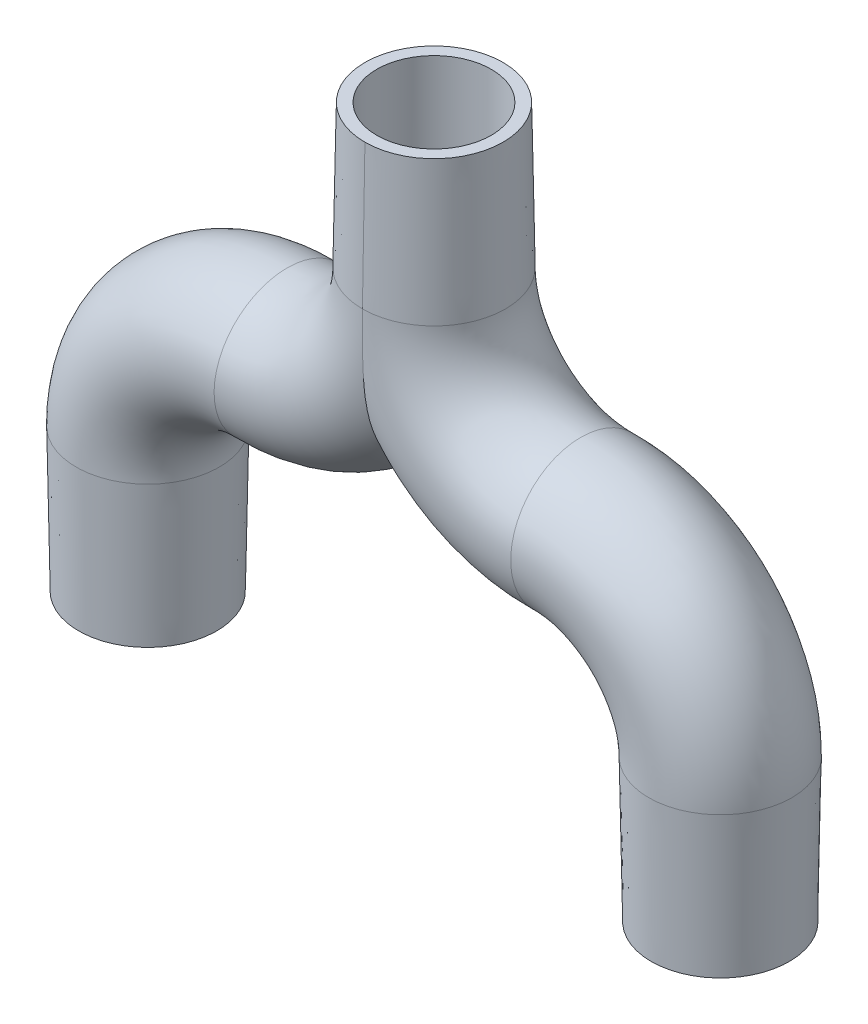
ISO-10303-21;
HEADER;
FILE_DESCRIPTION(('STEP AP214'),'2;1');
FILE_NAME('part.step','',(''),(''),'','','');
FILE_SCHEMA(('AUTOMOTIVE_DESIGN { 1 0 10303 214 1 1 1 1 }'));
ENDSEC;
DATA;
#1=APPLICATION_CONTEXT('core data for automotive mechanical design processes');
#2=APPLICATION_PROTOCOL_DEFINITION('international standard','automotive_design',2000,#1);
#3=PRODUCT_CONTEXT('',#1,'mechanical');
#4=PRODUCT('Part','Part','',(#3));
#5=PRODUCT_RELATED_PRODUCT_CATEGORY('part','',(#4));
#6=PRODUCT_DEFINITION_FORMATION('','',#4);
#7=PRODUCT_DEFINITION_CONTEXT('part definition',#1,'design');
#8=PRODUCT_DEFINITION('design','',#6,#7);
#9=PRODUCT_DEFINITION_SHAPE('','',#8);
#10=(LENGTH_UNIT() NAMED_UNIT(*) SI_UNIT(.MILLI.,.METRE.));
#11=(NAMED_UNIT(*) PLANE_ANGLE_UNIT() SI_UNIT($,.RADIAN.));
#12=(NAMED_UNIT(*) SI_UNIT($,.STERADIAN.) SOLID_ANGLE_UNIT());
#13=UNCERTAINTY_MEASURE_WITH_UNIT(LENGTH_MEASURE(1.E-05),#10,'distance_accuracy_value','');
#14=(GEOMETRIC_REPRESENTATION_CONTEXT(3) GLOBAL_UNCERTAINTY_ASSIGNED_CONTEXT((#13)) GLOBAL_UNIT_ASSIGNED_CONTEXT((#10,
#11,#12)) REPRESENTATION_CONTEXT('',''));
#15=CARTESIAN_POINT('',(0.,0.,0.));
#16=DIRECTION('',(0.,0.,1.));
#17=DIRECTION('',(1.,0.,0.));
#18=AXIS2_PLACEMENT_3D('',#15,#16,#17);
#19=CARTESIAN_POINT('',(0.,59.1431222892895,0.));
#20=DIRECTION('',(0.,-1.,0.));
#21=DIRECTION('',(0.,0.,1.));
#22=AXIS2_PLACEMENT_3D('',#19,#20,#21);
#23=CONICAL_SURFACE('',#22,10.,0.0174532925199434);
#24=CARTESIAN_POINT('',(0.,79.1431222892895,0.));
#25=DIRECTION('',(0.,1.,0.));
#26=DIRECTION('',(0.,0.,1.));
#27=AXIS2_PLACEMENT_3D('',#24,#25,#26);
#28=CIRCLE('',#27,9.65089870143565);
#29=CARTESIAN_POINT('',(0.,79.1431222892895,9.65089870143565));
#30=VERTEX_POINT('',#29);
#31=CARTESIAN_POINT('',(0.,79.1431222892895,-9.65089870143565));
#32=VERTEX_POINT('',#31);
#33=EDGE_CURVE('E346',#30,#32,#28,.T.);
#34=ORIENTED_EDGE('',*,*,#33,.F.);
#35=DIRECTION('',(0.,-0.999847695156391,0.0174524064372836));
#36=VECTOR('',#35,1.);
#37=CARTESIAN_POINT('',(0.,59.1431222892895,10.));
#38=LINE('',#37,#36);
#39=CARTESIAN_POINT('',(0.,59.1431222892895,10.));
#40=VERTEX_POINT('',#39);
#41=EDGE_CURVE('E12',#30,#40,#38,.T.);
#42=ORIENTED_EDGE('',*,*,#41,.T.);
#43=CARTESIAN_POINT('',(0.,59.1431222892895,0.));
#44=DIRECTION('',(0.,1.,0.));
#45=DIRECTION('',(0.,0.,1.));
#46=AXIS2_PLACEMENT_3D('',#43,#44,#45);
#47=CIRCLE('',#46,10.);
#48=CARTESIAN_POINT('',(0.,59.1431222892895,-10.));
#49=VERTEX_POINT('',#48);
#50=EDGE_CURVE('E149',#40,#49,#47,.T.);
#51=ORIENTED_EDGE('',*,*,#50,.T.);
#52=DIRECTION('',(0.,-0.999847695156391,-0.0174524064372836));
#53=VECTOR('',#52,1.);
#54=CARTESIAN_POINT('',(0.,59.1431222892895,-10.));
#55=LINE('',#54,#53);
#56=EDGE_CURVE('E67',#32,#49,#55,.T.);
#57=ORIENTED_EDGE('',*,*,#56,.F.);
#58=EDGE_LOOP('',(#34,#42,#51,#57));
#59=FACE_BOUND('',#58,.T.);
#60=ADVANCED_FACE('F57',(#59),#23,.T.);
#61=CARTESIAN_POINT('',(40.,0.,0.));
#62=DIRECTION('',(0.,1.,0.));
#63=DIRECTION('',(0.,0.,1.));
#64=AXIS2_PLACEMENT_3D('',#61,#62,#63);
#65=PLANE('',#64);
#66=CARTESIAN_POINT('',(40.,0.,0.));
#67=DIRECTION('',(0.,-1.,0.));
#68=DIRECTION('',(0.,0.,-1.));
#69=AXIS2_PLACEMENT_3D('',#66,#67,#68);
#70=CIRCLE('',#69,8.);
#71=CARTESIAN_POINT('',(40.,0.,-8.));
#72=VERTEX_POINT('',#71);
#73=EDGE_CURVE('E134',#72,#72,#70,.T.);
#74=ORIENTED_EDGE('',*,*,#73,.F.);
#75=EDGE_LOOP('',(#74));
#76=FACE_BOUND('',#75,.T.);
#77=CARTESIAN_POINT('',(40.,0.,0.));
#78=DIRECTION('',(0.,1.,0.));
#79=DIRECTION('',(0.,0.,1.));
#80=AXIS2_PLACEMENT_3D('',#77,#78,#79);
#81=CIRCLE('',#80,9.65089870143565);
#82=CARTESIAN_POINT('',(40.,0.,9.65089870143565));
#83=VERTEX_POINT('',#82);
#84=EDGE_CURVE('E85',#83,#83,#81,.T.);
#85=ORIENTED_EDGE('',*,*,#84,.F.);
#86=EDGE_LOOP('',(#85));
#87=FACE_BOUND('',#86,.T.);
#88=ADVANCED_FACE('F172',(#76,#87),#65,.F.);
#89=CARTESIAN_POINT('',(0.,79.1431222892895,0.));
#90=DIRECTION('',(0.,1.,0.));
#91=DIRECTION('',(0.,0.,1.));
#92=AXIS2_PLACEMENT_3D('',#89,#90,#91);
#93=PLANE('',#92);
#94=CARTESIAN_POINT('',(0.,79.1431222892895,0.));
#95=DIRECTION('',(0.,1.,0.));
#96=DIRECTION('',(0.,0.,1.));
#97=AXIS2_PLACEMENT_3D('',#94,#95,#96);
#98=CIRCLE('',#97,8.);
#99=CARTESIAN_POINT('',(0.,79.1431222892895,8.));
#100=VERTEX_POINT('',#99);
#101=EDGE_CURVE('E116',#100,#100,#98,.T.);
#102=ORIENTED_EDGE('',*,*,#101,.F.);
#103=EDGE_LOOP('',(#102));
#104=FACE_BOUND('',#103,.T.);
#105=CARTESIAN_POINT('',(0.,79.1431222892895,0.));
#106=DIRECTION('',(0.,1.,0.));
#107=DIRECTION('',(0.,0.,1.));
#108=AXIS2_PLACEMENT_3D('',#105,#106,#107);
#109=CIRCLE('',#108,9.65089870143565);
#110=EDGE_CURVE('E345',#32,#30,#109,.T.);
#111=ORIENTED_EDGE('',*,*,#110,.T.);
#112=ORIENTED_EDGE('',*,*,#33,.T.);
#113=EDGE_LOOP('',(#111,#112));
#114=FACE_BOUND('',#113,.T.);
#115=ADVANCED_FACE('F187',(#104,#114),#93,.T.);
#116=CARTESIAN_POINT('',(40.,20.,0.));
#117=DIRECTION('',(0.,1.,0.));
#118=DIRECTION('',(0.,0.,1.));
#119=AXIS2_PLACEMENT_3D('',#116,#117,#118);
#120=CONICAL_SURFACE('',#119,10.,0.0174532925199434);
#121=CARTESIAN_POINT('',(40.,20.,0.));
#122=DIRECTION('',(0.,1.,0.));
#123=DIRECTION('',(0.,0.,1.));
#124=AXIS2_PLACEMENT_3D('',#121,#122,#123);
#125=CIRCLE('',#124,10.);
#126=CARTESIAN_POINT('',(50.,20.,0.));
#127=VERTEX_POINT('',#126);
#128=EDGE_CURVE('E143',#127,#127,#125,.T.);
#129=ORIENTED_EDGE('',*,*,#128,.F.);
#130=EDGE_LOOP('',(#129));
#131=FACE_BOUND('',#130,.T.);
#132=ORIENTED_EDGE('',*,*,#84,.T.);
#133=EDGE_LOOP('',(#132));
#134=FACE_BOUND('',#133,.T.);
#135=ADVANCED_FACE('F180',(#131,#134),#120,.T.);
#136=CARTESIAN_POINT('',(21.1317876280369,20.,0.));
#137=DIRECTION('',(0.,0.,1.));
#138=DIRECTION('',(1.,0.,0.));
#139=AXIS2_PLACEMENT_3D('',#136,#137,#138);
#140=TOROIDAL_SURFACE('',#139,18.8682123719631,10.);
#141=CARTESIAN_POINT('',(20.7232655694847,38.8637893287955,0.));
#142=DIRECTION('',(-0.999765582288325,-0.0216513387966339,0.));
#143=DIRECTION('',(0.,0.,1.));
#144=AXIS2_PLACEMENT_3D('',#141,#142,#143);
#145=CIRCLE('',#144,10.);
#146=CARTESIAN_POINT('',(20.5067521815183,48.8614451516788,0.));
#147=VERTEX_POINT('',#146);
#148=EDGE_CURVE('E146',#147,#147,#145,.T.);
#149=CARTESIAN_POINT('',(21.1317876280369,20.,0.));
#150=DIRECTION('',(0.,0.,1.));
#151=DIRECTION('',(1.,0.,0.));
#152=AXIS2_PLACEMENT_3D('',#149,#150,#151);
#153=CIRCLE('',#152,28.8682123719631);
#154=EDGE_CURVE('',#127,#147,#153,.T.);
#155=ORIENTED_EDGE('',*,*,#128,.T.);
#156=ORIENTED_EDGE('',*,*,#148,.F.);
#157=ORIENTED_EDGE('',*,*,#154,.T.);
#158=ORIENTED_EDGE('',*,*,#154,.F.);
#159=EDGE_LOOP('',(#155,#157,#156,#158));
#160=FACE_BOUND('',#159,.T.);
#161=ADVANCED_FACE('F178',(#160),#140,.T.);
#162=CARTESIAN_POINT('',(20.2840879099653,59.1431222892895,0.));
#163=DIRECTION('',(0.,0.,-1.));
#164=DIRECTION('',(-1.,0.,0.));
#165=AXIS2_PLACEMENT_3D('',#162,#163,#164);
#166=TOROIDAL_SURFACE('',#165,20.2840879099653,10.);
#167=CARTESIAN_POINT('',(0.,59.1431222892895,-10.));
#168=CARTESIAN_POINT('',(0.,59.075983812123,-9.99999924301989));
#169=CARTESIAN_POINT('',(0.,59.0088453351664,-9.99999946741686));
#170=CARTESIAN_POINT('',(0.,58.5638779012477,-10.0000026658046));
#171=CARTESIAN_POINT('',(0.,58.186048948632,-10.0000135584307));
#172=CARTESIAN_POINT('',(0.,57.430390592289,-9.99979391511942));
#173=CARTESIAN_POINT('',(0.,57.0525611885617,-9.99956337890349));
#174=CARTESIAN_POINT('',(0.,56.2968568774636,-9.99819724614081));
#175=CARTESIAN_POINT('',(0.,55.9189819702118,-9.99706153827782));
#176=CARTESIAN_POINT('',(0.,55.1632404765593,-9.99286565151304));
#177=CARTESIAN_POINT('',(0.,54.7853738901686,-9.98980547042301));
#178=CARTESIAN_POINT('',(0.,54.0292215940289,-9.98041396039134));
#179=CARTESIAN_POINT('',(0.,53.6509359278018,-9.97407869486548));
#180=CARTESIAN_POINT('',(0.,52.8944691357887,-9.95651193168939));
#181=CARTESIAN_POINT('',(0.,52.5162880106689,-9.94528040352945));
#182=CARTESIAN_POINT('',(0.,51.7602596173793,-9.91606876856311));
#183=CARTESIAN_POINT('',(0.,51.3824122922814,-9.89809022073307));
#184=CARTESIAN_POINT('',(0.,50.6272376410586,-9.85333636583328));
#185=CARTESIAN_POINT('',(0.,50.2499103075513,-9.82656118497091));
#186=CARTESIAN_POINT('',(0.,49.332288415465,-9.74798134407743));
#187=CARTESIAN_POINT('',(0.,48.7924608815508,-9.6903558369953));
#188=CARTESIAN_POINT('',(0.,47.7165510950558,-9.54550507048272));
#189=CARTESIAN_POINT('',(0.,47.1804696724682,-9.45827345122531));
#190=CARTESIAN_POINT('',(0.,46.1169943301517,-9.2471617202654));
#191=CARTESIAN_POINT('',(0.,45.5895793934723,-9.12339084479277));
#192=CARTESIAN_POINT('',(0.,44.5471495966799,-8.83182100180424));
#193=CARTESIAN_POINT('',(0.,44.0321303371283,-8.66403791425669));
#194=CARTESIAN_POINT('',(0.,42.922273008748,-8.23914071468609));
#195=CARTESIAN_POINT('',(0.,42.3314754496497,-7.97098275492256));
#196=CARTESIAN_POINT('',(0.,41.4797488464761,-7.50609425394877));
#197=CARTESIAN_POINT('',(0.,41.2015427637305,-7.34065769349426));
#198=CARTESIAN_POINT('',(0.,40.6593096127529,-6.98787188760467));
#199=CARTESIAN_POINT('',(0.,40.3952798811324,-6.80052677941613));
#200=CARTESIAN_POINT('',(0.,39.9303985318301,-6.43893651323199));
#201=CARTESIAN_POINT('',(0.,39.7266979039141,-6.26834935324615));
#202=CARTESIAN_POINT('',(0.,39.3330589139682,-5.91198549827202));
#203=CARTESIAN_POINT('',(0.,39.1431177011746,-5.72621196676843));
#204=CARTESIAN_POINT('',(0.,38.7792428246492,-5.33982765980739));
#205=CARTESIAN_POINT('',(0.,38.6052970618988,-5.13922830931353));
#206=CARTESIAN_POINT('',(0.,38.2754995195259,-4.72365350294544));
#207=CARTESIAN_POINT('',(0.,38.1196450444165,-4.50868019624101));
#208=CARTESIAN_POINT('',(0.,37.8506365159316,-4.09935453062706));
#209=CARTESIAN_POINT('',(0.,37.7345993237203,-3.9068940854619));
#210=CARTESIAN_POINT('',(0.,37.5184602540885,-3.51323804921208));
#211=CARTESIAN_POINT('',(0.,37.418355593524,-3.31204399157409));
#212=CARTESIAN_POINT('',(0.,37.2353394628941,-2.90200471862412));
#213=CARTESIAN_POINT('',(0.,37.1524252604485,-2.69316072546916));
#214=CARTESIAN_POINT('',(0.,37.0048896444262,-2.26908888364854));
#215=CARTESIAN_POINT('',(0.,36.940268523598,-2.05386093287984));
#216=CARTESIAN_POINT('',(0.,36.8300366299147,-1.61769066405441));
#217=CARTESIAN_POINT('',(0.,36.7845004783878,-1.39672943753023));
#218=CARTESIAN_POINT('',(0.,36.713490783371,-0.951597015030077));
#219=CARTESIAN_POINT('',(0.,36.6880173601315,-0.727425799822504));
#220=CARTESIAN_POINT('',(0.,36.6575323446161,-0.277724138376335));
#221=CARTESIAN_POINT('',(0.,36.6525180226172,-0.0521938774878119));
#222=CARTESIAN_POINT('',(0.,36.6630241441215,0.398380017605707));
#223=CARTESIAN_POINT('',(0.,36.6785435626645,0.623423675538306));
#224=CARTESIAN_POINT('',(0.,36.7281241771027,1.05596855408723));
#225=CARTESIAN_POINT('',(0.,36.7608554666154,1.26362376039801));
#226=CARTESIAN_POINT('',(0.,36.8435197216063,1.67556626387057));
#227=CARTESIAN_POINT('',(0.,36.8934596762226,1.87985215723856));
#228=CARTESIAN_POINT('',(0.,37.0098837336256,2.28360972402299));
#229=CARTESIAN_POINT('',(0.,37.0763653692261,2.48308211050973));
#230=CARTESIAN_POINT('',(0.,37.2250295547603,2.87599601131134));
#231=CARTESIAN_POINT('',(0.,37.3072067646003,3.0694395508539));
#232=CARTESIAN_POINT('',(0.,37.4889514826294,3.45492717450976));
#233=CARTESIAN_POINT('',(0.,37.5889582849423,3.64676387445959));
#234=CARTESIAN_POINT('',(0.,37.8034639899514,4.02213173117092));
#235=CARTESIAN_POINT('',(0.,37.9179627429016,4.20566297372648));
#236=CARTESIAN_POINT('',(0.,38.160295166054,4.56378310134953));
#237=CARTESIAN_POINT('',(0.,38.2881337486749,4.73836865661071));
#238=CARTESIAN_POINT('',(0.,38.5558942068481,5.07802747759512));
#239=CARTESIAN_POINT('',(0.,38.6958183045405,5.24309898464625));
#240=CARTESIAN_POINT('',(0.,39.0440540323608,5.62673521267059));
#241=CARTESIAN_POINT('',(0.,39.2575260754175,5.84063616688665));
#242=CARTESIAN_POINT('',(0.,39.7024848277928,6.24880336092624));
#243=CARTESIAN_POINT('',(0.,39.9339771393798,6.44306345116319));
#244=CARTESIAN_POINT('',(0.,40.4122266742251,6.81216413588592));
#245=CARTESIAN_POINT('',(0.,40.6589968352449,6.98698791097728));
#246=CARTESIAN_POINT('',(0.,41.1651133645114,7.3175896587183));
#247=CARTESIAN_POINT('',(0.,41.4244671243102,7.47335624338177));
#248=CARTESIAN_POINT('',(0.,42.0733318534134,7.83303093672842));
#249=CARTESIAN_POINT('',(0.,42.4685179162139,8.02672535261503));
#250=CARTESIAN_POINT('',(0.,43.2745450635367,8.37844621935104));
#251=CARTESIAN_POINT('',(0.,43.6853953776099,8.53645124981308));
#252=CARTESIAN_POINT('',(0.,44.3101190955394,8.74948990849083));
#253=CARTESIAN_POINT('',(0.,44.5199886731571,8.81656461110377));
#254=CARTESIAN_POINT('',(0.,44.9419083863942,8.94312211286583));
#255=CARTESIAN_POINT('',(0.,45.1539575406804,9.00260817972736));
#256=CARTESIAN_POINT('',(0.,45.7927913594485,9.17044277365304));
#257=CARTESIAN_POINT('',(0.,46.2223752468414,9.26820549337401));
#258=CARTESIAN_POINT('',(0.,47.1569544052796,9.45345846846442));
#259=CARTESIAN_POINT('',(0.,47.6627840310905,9.53664819249601));
#260=CARTESIAN_POINT('',(0.,48.6781781084414,9.67634138355971));
#261=CARTESIAN_POINT('',(0.,49.1877437857123,9.73283565428939));
#262=CARTESIAN_POINT('',(0.,50.2095174962853,9.8250679085142));
#263=CARTESIAN_POINT('',(0.,50.7217284979271,9.86077158286311));
#264=CARTESIAN_POINT('',(0.,51.7468870056515,9.91678361861229));
#265=CARTESIAN_POINT('',(0.,52.2598344327598,9.93709352288794));
#266=CARTESIAN_POINT('',(0.,53.2869891934437,9.96730053361504));
#267=CARTESIAN_POINT('',(0.,53.8011970567909,9.97717759750503));
#268=CARTESIAN_POINT('',(0.,54.8296867936197,9.99069430822574));
#269=CARTESIAN_POINT('',(0.,55.3439686680502,9.99433386630744));
#270=CARTESIAN_POINT('',(0.,56.3721627818031,9.99868001377743));
#271=CARTESIAN_POINT('',(0.,56.8860750157687,9.99938875093512));
#272=CARTESIAN_POINT('',(0.,57.9138937696136,10.0000523120199));
#273=CARTESIAN_POINT('',(0.,58.427800289495,10.0000071440529));
#274=CARTESIAN_POINT('',(0.,59.0088453343885,9.99999901014761));
#275=CARTESIAN_POINT('',(0.,59.0759838112614,9.9999987184196));
#276=CARTESIAN_POINT('',(0.,59.1431222892895,10.));
#277=B_SPLINE_CURVE_WITH_KNOTS('',3,(#167,#168,#169,#170,#171,#172,#173,#174,#175,#176,#177,
#178,#179,#180,#181,#182,#183,#184,#185,#186,#187,#188,#189,#190,#191,#192,#193,#194,#195,#196,
#197,#198,#199,#200,#201,#202,#203,#204,#205,#206,#207,#208,#209,#210,#211,#212,#213,#214,#215,
#216,#217,#218,#219,#220,#221,#222,#223,#224,#225,#226,#227,#228,#229,#230,#231,#232,#233,#234,
#235,#236,#237,#238,#239,#240,#241,#242,#243,#244,#245,#246,#247,#248,#249,#250,#251,#252,#253,
#254,#255,#256,#257,#258,#259,#260,#261,#262,#263,#264,#265,#266,#267,#268,#269,#270,#271,#272,
#273,#274,#275,#276),.UNSPECIFIED.,.F.,.F.,(4,2,2,2,2,2,2,2,2,2,2,2,2,2,2,2,2,2,2,2,2,2,2,2,2,2,
2,2,2,2,2,2,2,2,2,2,2,2,2,2,2,2,2,2,2,2,2,2,2,2,2,2,2,2,4),(0.,0.201415430937982,
1.33490230502574,2.4683904864336,3.60201808349313,4.73564696955357,5.87064163338113,
7.00564336971619,8.14038301217685,9.27510637496811,10.9031459517408,12.5315354768695,
14.1551053018394,15.7780901332818,17.7178460184959,18.6880375761426,19.6580462161646,
20.4544203533643,21.2506290179399,22.0462303862024,22.8417130623467,23.5152299617134,
24.1886290796336,24.861921080262,25.5352238551272,26.2111351917833,26.8870505796363,
27.5628757816098,28.238667250433,28.8685931357362,29.498775161663,30.1288632524332,
30.7587373494401,31.4070821224604,32.0554201966528,32.703997870876,33.3526950527081,
34.25795034112,35.1634881943686,36.0698036619758,36.9766580974049,38.2948738928337,
39.6138787773238,40.2747425402471,40.9353207637217,42.2561208998186,43.7931083346072,
45.3306248600682,46.8706714943487,48.4105637535599,49.9534089537591,51.4962761058179,
53.0380124106553,54.5797321388645,54.7811475698025),.UNSPECIFIED.);
#278=EDGE_CURVE('E151',#49,#40,#277,.T.);
#279=ORIENTED_EDGE('',*,*,#278,.F.);
#280=ORIENTED_EDGE('',*,*,#50,.F.);
#281=EDGE_LOOP('',(#279,#280));
#282=FACE_BOUND('',#281,.T.);
#283=ORIENTED_EDGE('',*,*,#148,.T.);
#284=EDGE_LOOP('',(#283));
#285=FACE_BOUND('',#284,.T.);
#286=ADVANCED_FACE('F160',(#282,#285),#166,.T.);
#287=CARTESIAN_POINT('',(0.,59.1431222892895,0.));
#288=DIRECTION('',(0.,-1.,0.));
#289=DIRECTION('',(0.,0.,-1.));
#290=AXIS2_PLACEMENT_3D('',#287,#288,#289);
#291=CONICAL_SURFACE('',#290,10.,0.0174532925199434);
#292=ORIENTED_EDGE('',*,*,#41,.F.);
#293=ORIENTED_EDGE('',*,*,#110,.F.);
#294=ORIENTED_EDGE('',*,*,#56,.T.);
#295=CARTESIAN_POINT('',(0.,59.1431222892895,0.));
#296=DIRECTION('',(0.,1.,0.));
#297=DIRECTION('',(0.,0.,-1.));
#298=AXIS2_PLACEMENT_3D('',#295,#296,#297);
#299=CIRCLE('',#298,10.);
#300=EDGE_CURVE('E142',#49,#40,#299,.T.);
#301=ORIENTED_EDGE('',*,*,#300,.T.);
#302=EDGE_LOOP('',(#292,#293,#294,#301));
#303=FACE_BOUND('',#302,.T.);
#304=ADVANCED_FACE('F176',(#303),#291,.T.);
#305=CARTESIAN_POINT('',(-40.,0.,0.));
#306=DIRECTION('',(0.,1.,0.));
#307=DIRECTION('',(0.,0.,-1.));
#308=AXIS2_PLACEMENT_3D('',#305,#306,#307);
#309=PLANE('',#308);
#310=CARTESIAN_POINT('',(-40.,0.,0.));
#311=DIRECTION('',(0.,-1.,0.));
#312=DIRECTION('',(0.,0.,-1.));
#313=AXIS2_PLACEMENT_3D('',#310,#311,#312);
#314=CIRCLE('',#313,8.);
#315=CARTESIAN_POINT('',(-40.,0.,-8.));
#316=VERTEX_POINT('',#315);
#317=EDGE_CURVE('E376',#316,#316,#314,.T.);
#318=ORIENTED_EDGE('',*,*,#317,.F.);
#319=EDGE_LOOP('',(#318));
#320=FACE_BOUND('',#319,.T.);
#321=CARTESIAN_POINT('',(-40.,0.,0.));
#322=DIRECTION('',(0.,1.,0.));
#323=DIRECTION('',(0.,0.,1.));
#324=AXIS2_PLACEMENT_3D('',#321,#322,#323);
#325=CIRCLE('',#324,9.65089870143565);
#326=CARTESIAN_POINT('',(-40.,0.,-9.65089870143565));
#327=VERTEX_POINT('',#326);
#328=EDGE_CURVE('E61',#327,#327,#325,.T.);
#329=ORIENTED_EDGE('',*,*,#328,.F.);
#330=EDGE_LOOP('',(#329));
#331=FACE_BOUND('',#330,.T.);
#332=ADVANCED_FACE('F174',(#320,#331),#309,.F.);
#333=CARTESIAN_POINT('',(-40.,20.,0.));
#334=DIRECTION('',(0.,1.,0.));
#335=DIRECTION('',(0.,0.,-1.));
#336=AXIS2_PLACEMENT_3D('',#333,#334,#335);
#337=CONICAL_SURFACE('',#336,10.,0.0174532925199434);
#338=CARTESIAN_POINT('',(-40.,20.,0.));
#339=DIRECTION('',(0.,1.,0.));
#340=DIRECTION('',(0.,0.,-1.));
#341=AXIS2_PLACEMENT_3D('',#338,#339,#340);
#342=CIRCLE('',#341,10.);
#343=CARTESIAN_POINT('',(-50.,20.,0.));
#344=VERTEX_POINT('',#343);
#345=EDGE_CURVE('E136',#344,#344,#342,.T.);
#346=ORIENTED_EDGE('',*,*,#345,.F.);
#347=EDGE_LOOP('',(#346));
#348=FACE_BOUND('',#347,.T.);
#349=ORIENTED_EDGE('',*,*,#328,.T.);
#350=EDGE_LOOP('',(#349));
#351=FACE_BOUND('',#350,.T.);
#352=ADVANCED_FACE('F59',(#348,#351),#337,.T.);
#353=CARTESIAN_POINT('',(-21.1317876280369,20.,0.));
#354=DIRECTION('',(0.,0.,-1.));
#355=DIRECTION('',(-1.,0.,0.));
#356=AXIS2_PLACEMENT_3D('',#353,#354,#355);
#357=TOROIDAL_SURFACE('',#356,18.8682123719631,10.);
#358=CARTESIAN_POINT('',(-20.7232655694847,38.8637893287955,0.));
#359=DIRECTION('',(0.999765582288325,-0.0216513387966339,0.));
#360=DIRECTION('',(0.,0.,-1.));
#361=AXIS2_PLACEMENT_3D('',#358,#359,#360);
#362=CIRCLE('',#361,10.);
#363=CARTESIAN_POINT('',(-20.5067521815183,48.8614451516788,0.));
#364=VERTEX_POINT('',#363);
#365=EDGE_CURVE('E139',#364,#364,#362,.T.);
#366=CARTESIAN_POINT('',(-21.1317876280369,20.,0.));
#367=DIRECTION('',(0.,0.,-1.));
#368=DIRECTION('',(-1.,0.,0.));
#369=AXIS2_PLACEMENT_3D('',#366,#367,#368);
#370=CIRCLE('',#369,28.8682123719631);
#371=EDGE_CURVE('',#344,#364,#370,.T.);
#372=ORIENTED_EDGE('',*,*,#345,.T.);
#373=ORIENTED_EDGE('',*,*,#365,.F.);
#374=ORIENTED_EDGE('',*,*,#371,.T.);
#375=ORIENTED_EDGE('',*,*,#371,.F.);
#376=EDGE_LOOP('',(#372,#374,#373,#375));
#377=FACE_BOUND('',#376,.T.);
#378=ADVANCED_FACE('F170',(#377),#357,.T.);
#379=CARTESIAN_POINT('',(-20.2840879099653,59.1431222892895,0.));
#380=DIRECTION('',(0.,0.,1.));
#381=DIRECTION('',(1.,0.,0.));
#382=AXIS2_PLACEMENT_3D('',#379,#380,#381);
#383=TOROIDAL_SURFACE('',#382,20.2840879099653,10.);
#384=ORIENTED_EDGE('',*,*,#300,.F.);
#385=ORIENTED_EDGE('',*,*,#278,.T.);
#386=EDGE_LOOP('',(#384,#385));
#387=FACE_BOUND('',#386,.T.);
#388=ORIENTED_EDGE('',*,*,#365,.T.);
#389=EDGE_LOOP('',(#388));
#390=FACE_BOUND('',#389,.T.);
#391=ADVANCED_FACE('F164',(#387,#390),#383,.T.);
#392=CARTESIAN_POINT('',(40.,0.,0.));
#393=DIRECTION('',(0.,1.,0.));
#394=DIRECTION('',(0.,0.,1.));
#395=AXIS2_PLACEMENT_3D('',#392,#393,#394);
#396=CYLINDRICAL_SURFACE('',#395,8.);
#397=CARTESIAN_POINT('',(40.,20.,0.));
#398=DIRECTION('',(0.,-1.,0.));
#399=DIRECTION('',(1.,0.,0.));
#400=AXIS2_PLACEMENT_3D('',#397,#398,#399);
#401=CIRCLE('',#400,8.);
#402=CARTESIAN_POINT('',(48.,20.,0.));
#403=VERTEX_POINT('',#402);
#404=EDGE_CURVE('E107',#403,#403,#401,.F.);
#405=ORIENTED_EDGE('',*,*,#404,.T.);
#406=EDGE_LOOP('',(#405));
#407=FACE_BOUND('',#406,.T.);
#408=ORIENTED_EDGE('',*,*,#73,.T.);
#409=EDGE_LOOP('',(#408));
#410=FACE_BOUND('',#409,.T.);
#411=ADVANCED_FACE('F169',(#407,#410),#396,.F.);
#412=CARTESIAN_POINT('',(21.1317876280369,20.,0.));
#413=DIRECTION('',(0.,0.,1.));
#414=DIRECTION('',(1.,0.,0.));
#415=AXIS2_PLACEMENT_3D('',#412,#413,#414);
#416=TOROIDAL_SURFACE('',#415,18.8682123719631,8.);
#417=CARTESIAN_POINT('',(20.7232655694847,38.8637893287955,0.));
#418=DIRECTION('',(0.999765582288325,0.0216513387966351,0.));
#419=DIRECTION('',(-0.0216513387966351,0.999765582288325,0.));
#420=AXIS2_PLACEMENT_3D('',#417,#418,#419);
#421=CIRCLE('',#420,8.);
#422=CARTESIAN_POINT('',(20.5500548591116,46.8619139871021,0.));
#423=VERTEX_POINT('',#422);
#424=EDGE_CURVE('E117',#423,#423,#421,.F.);
#425=CARTESIAN_POINT('',(21.1317876280369,20.,0.));
#426=DIRECTION('',(0.,0.,1.));
#427=DIRECTION('',(1.,0.,0.));
#428=AXIS2_PLACEMENT_3D('',#425,#426,#427);
#429=CIRCLE('',#428,26.8682123719631);
#430=EDGE_CURVE('',#403,#423,#429,.T.);
#431=ORIENTED_EDGE('',*,*,#404,.F.);
#432=ORIENTED_EDGE('',*,*,#424,.T.);
#433=ORIENTED_EDGE('',*,*,#430,.T.);
#434=ORIENTED_EDGE('',*,*,#430,.F.);
#435=EDGE_LOOP('',(#431,#433,#432,#434));
#436=FACE_BOUND('',#435,.T.);
#437=ADVANCED_FACE('F234',(#436),#416,.F.);
#438=CARTESIAN_POINT('',(20.2840879099653,59.1431222892895,0.));
#439=DIRECTION('',(0.,0.,-1.));
#440=DIRECTION('',(-1.,0.,0.));
#441=AXIS2_PLACEMENT_3D('',#438,#439,#440);
#442=TOROIDAL_SURFACE('',#441,20.2840879099653,8.);
#443=CARTESIAN_POINT('',(0.,59.1431222892895,-8.));
#444=CARTESIAN_POINT('',(0.,59.0759838117079,-7.99999888847396));
#445=CARTESIAN_POINT('',(0.,59.0088453348007,-7.99999919241842));
#446=CARTESIAN_POINT('',(0.,58.5259986299056,-8.00000455092065));
#447=CARTESIAN_POINT('',(0.,58.110290419018,-8.00002607695934));
#448=CARTESIAN_POINT('',(0.,57.2788714157582,-7.99964037229336));
#449=CARTESIAN_POINT('',(0.,56.8631606233857,-7.99923313899594));
#450=CARTESIAN_POINT('',(0.,56.0315719751559,-7.99679032303519));
#451=CARTESIAN_POINT('',(0.,55.6156941204731,-7.99475407479296));
#452=CARTESIAN_POINT('',(0.,54.7839683161669,-7.98721049110341));
#453=CARTESIAN_POINT('',(0.,54.3681203662743,-7.98170319228037));
#454=CARTESIAN_POINT('',(0.,53.5372585268948,-7.96481595473354));
#455=CARTESIAN_POINT('',(0.,53.1222444498382,-7.95344629576665));
#456=CARTESIAN_POINT('',(0.,52.2924981081376,-7.92194373920983));
#457=CARTESIAN_POINT('',(0.,51.877765864348,-7.90181025167558));
#458=CARTESIAN_POINT('',(0.,51.0494072937271,-7.8494796619031));
#459=CARTESIAN_POINT('',(0.,50.6357803073572,-7.81729343815441));
#460=CARTESIAN_POINT('',(0.,49.8100836789448,-7.73716820193429));
#461=CARTESIAN_POINT('',(0.,49.3980137116652,-7.68923268692688));
#462=CARTESIAN_POINT('',(0.,48.6804175790181,-7.58817914800102));
#463=CARTESIAN_POINT('',(0.,48.3742805122762,-7.53943150032318));
#464=CARTESIAN_POINT('',(0.,47.7642710295326,-7.42906233920636));
#465=CARTESIAN_POINT('',(0.,47.4603988583664,-7.36743945427154));
#466=CARTESIAN_POINT('',(0.,46.8556077251968,-7.2293403323395));
#467=CARTESIAN_POINT('',(0.,46.554692992422,-7.15284537621244));
#468=CARTESIAN_POINT('',(0.,45.9576033060841,-6.98307639334881));
#469=CARTESIAN_POINT('',(0.,45.6614281483495,-6.88980309151974));
#470=CARTESIAN_POINT('',(0.,45.0722362577575,-6.68326611068054));
#471=CARTESIAN_POINT('',(0.,44.7792951222754,-6.56978468749834));
#472=CARTESIAN_POINT('',(0.,44.2024724049946,-6.3214776691517));
#473=CARTESIAN_POINT('',(0.,43.9185923192381,-6.1866485710185));
#474=CARTESIAN_POINT('',(0.,43.3636110803993,-5.89397145692391));
#475=CARTESIAN_POINT('',(0.,43.0924835919021,-5.7361739081492));
#476=CARTESIAN_POINT('',(0.,42.5664416889234,-5.39582343500299));
#477=CARTESIAN_POINT('',(0.,42.3115177062064,-5.21328532332435));
#478=CARTESIAN_POINT('',(0.,41.7555246067556,-4.76857414114961));
#479=CARTESIAN_POINT('',(0.,41.4607851070921,-4.49824968801275));
#480=CARTESIAN_POINT('',(0.,41.0529311035308,-4.06103339623056));
#481=CARTESIAN_POINT('',(0.,40.922641450157,-3.90993621276673));
#482=CARTESIAN_POINT('',(0.,40.6751139815231,-3.5974432751575));
#483=CARTESIAN_POINT('',(0.,40.557869859801,-3.43605255699156));
#484=CARTESIAN_POINT('',(0.,40.3369311945128,-3.10170382437651));
#485=CARTESIAN_POINT('',(0.,40.2333970080803,-2.92863953380905));
#486=CARTESIAN_POINT('',(0.,40.0432075573332,-2.57355312773666));
#487=CARTESIAN_POINT('',(0.,39.9565433202912,-2.39153583901203));
#488=CARTESIAN_POINT('',(0.,39.8017503245909,-2.01989040346592));
#489=CARTESIAN_POINT('',(0.,39.7336099784382,-1.83026710013205));
#490=CARTESIAN_POINT('',(0.,39.6172559886699,-1.44500414574433));
#491=CARTESIAN_POINT('',(0.,39.5690385065868,-1.24936566142542));
#492=CARTESIAN_POINT('',(0.,39.4989705689733,-0.882136959236169));
#493=CARTESIAN_POINT('',(0.,39.4743505777429,-0.711070971827695));
#494=CARTESIAN_POINT('',(0.,39.4410150983094,-0.367401554677534));
#495=CARTESIAN_POINT('',(0.,39.4322978676989,-0.194798295451762));
#496=CARTESIAN_POINT('',(0.,39.4309247546078,0.150410079090178));
#497=CARTESIAN_POINT('',(0.,39.4382634050036,0.323015173768296));
#498=CARTESIAN_POINT('',(0.,39.4688578082468,0.666803898348689));
#499=CARTESIAN_POINT('',(0.,39.4921130458978,0.837987574078674));
#500=CARTESIAN_POINT('',(0.,39.5514026075853,1.16262233910877));
#501=CARTESIAN_POINT('',(0.,39.5861385086239,1.31631280221297));
#502=CARTESIAN_POINT('',(0.,39.6680277089235,1.62039548529925));
#503=CARTESIAN_POINT('',(0.,39.7151848340528,1.77078667358234));
#504=CARTESIAN_POINT('',(0.,39.8212545626393,2.06728502598499));
#505=CARTESIAN_POINT('',(0.,39.8801624069201,2.21339389710395));
#506=CARTESIAN_POINT('',(0.,40.0090254664588,2.50070520206439));
#507=CARTESIAN_POINT('',(0.,40.0789847878291,2.64190578837618));
#508=CARTESIAN_POINT('',(0.,40.2336673033149,2.92711531498581));
#509=CARTESIAN_POINT('',(0.,40.3190267860145,3.07077926845663));
#510=CARTESIAN_POINT('',(0.,40.5002437777114,3.35134996739121));
#511=CARTESIAN_POINT('',(0.,40.596105366457,3.48825405667959));
#512=CARTESIAN_POINT('',(0.,40.8979722320478,3.88825241997767));
#513=CARTESIAN_POINT('',(0.,41.1183015547236,4.14070870119851));
#514=CARTESIAN_POINT('',(0.,41.532753567196,4.55869692746902));
#515=CARTESIAN_POINT('',(0.,41.7206008376706,4.73060306998265));
#516=CARTESIAN_POINT('',(0.,42.1107755394828,5.05721707621148));
#517=CARTESIAN_POINT('',(0.,42.3131090363961,5.21191766568598));
#518=CARTESIAN_POINT('',(0.,42.938258556476,5.65120066459039));
#519=CARTESIAN_POINT('',(0.,43.3789068625896,5.91065570604878));
#520=CARTESIAN_POINT('',(0.,44.1907678243055,6.31922635200841));
#521=CARTESIAN_POINT('',(0.,44.5563257244756,6.48006863237969));
#522=CARTESIAN_POINT('',(0.,45.3003507402939,6.76914146170293));
#523=CARTESIAN_POINT('',(0.,45.6788263137614,6.89735016063126));
#524=CARTESIAN_POINT('',(0.,46.4449007897737,7.12549565467881));
#525=CARTESIAN_POINT('',(0.,46.8325170842014,7.22537288802143));
#526=CARTESIAN_POINT('',(0.,47.6130027818624,7.40074467974011));
#527=CARTESIAN_POINT('',(0.,48.0058704255292,7.47624720212816));
#528=CARTESIAN_POINT('',(0.,48.8340672754761,7.61343638144122));
#529=CARTESIAN_POINT('',(0.,49.2697401068782,7.67300748957306));
#530=CARTESIAN_POINT('',(0.,50.143355877025,7.7726206919146));
#531=CARTESIAN_POINT('',(0.,50.5812994160625,7.812657324727));
#532=CARTESIAN_POINT('',(0.,51.4587753432738,7.87778215731734));
#533=CARTESIAN_POINT('',(0.,51.8983090055143,7.90285241469872));
#534=CARTESIAN_POINT('',(0.,52.7777926380242,7.94208377423776));
#535=CARTESIAN_POINT('',(0.,53.2177425693319,7.9562458123645));
#536=CARTESIAN_POINT('',(0.,54.0981142016148,7.97726520271713));
#537=CARTESIAN_POINT('',(0.,54.5385360147611,7.98411731415528));
#538=CARTESIAN_POINT('',(0.,55.4194226511038,7.99349881159826));
#539=CARTESIAN_POINT('',(0.,55.8598874747774,7.99602814241602));
#540=CARTESIAN_POINT('',(0.,56.7405798486112,7.99905813363609));
#541=CARTESIAN_POINT('',(0.,57.180807396495,7.9995599052281));
#542=CARTESIAN_POINT('',(0.,58.0612589072468,8.00003357207552));
#543=CARTESIAN_POINT('',(0.,58.5014828701156,8.0000054715294));
#544=CARTESIAN_POINT('',(0.,59.0088453346536,7.99999909350979));
#545=CARTESIAN_POINT('',(0.,59.0759838115456,7.99999877439663));
#546=CARTESIAN_POINT('',(0.,59.1431222892895,8.));
#547=B_SPLINE_CURVE_WITH_KNOTS('',3,(#443,#444,#445,#446,#447,#448,#449,#450,#451,#452,#453,
#454,#455,#456,#457,#458,#459,#460,#461,#462,#463,#464,#465,#466,#467,#468,#469,#470,#471,#472,
#473,#474,#475,#476,#477,#478,#479,#480,#481,#482,#483,#484,#485,#486,#487,#488,#489,#490,#491,
#492,#493,#494,#495,#496,#497,#498,#499,#500,#501,#502,#503,#504,#505,#506,#507,#508,#509,#510,
#511,#512,#513,#514,#515,#516,#517,#518,#519,#520,#521,#522,#523,#524,#525,#526,#527,#528,#529,
#530,#531,#532,#533,#534,#535,#536,#537,#538,#539,#540,#541,#542,#543,#544,#545,#546),
.UNSPECIFIED.,.F.,.F.,(4,2,2,2,2,2,2,2,2,2,2,2,2,2,2,2,2,2,2,2,2,2,2,2,2,2,2,2,2,2,2,2,2,2,2,2,
2,2,2,2,2,2,2,2,2,2,2,2,2,2,2,4),(0.,0.201415430937986,1.44854012612302,2.69567236283503,
3.94331441015634,5.1909432933855,6.43639183910934,7.68192423619367,8.92633514682534,
10.1704698962072,11.1002234640243,12.030076121577,12.961106830025,13.892097322999,
14.8338041315519,15.7756656264982,16.715488021027,17.6547501895957,18.8497026435236,
19.4476814959623,20.0453700062971,20.6495264220507,21.2533606179767,21.8568162157691,
22.4601554936367,22.9779311924503,23.4956501570647,24.0131928627146,24.530718817066,
25.0028935331104,25.4752138543706,25.9473432674572,26.419648511875,26.9204640513063,
27.4214748368363,28.4232386427383,29.1861722953377,29.9494272880209,31.4772473906929,
32.6738744478464,33.8713006191351,35.0712258143345,36.2707585571633,37.5893691543014,
38.9083481941868,40.2289053293252,41.5493491427227,42.8707390018144,44.1921457303919,
45.5128281729151,46.8335001509455,47.0349155818835),.UNSPECIFIED.);
#548=CARTESIAN_POINT('',(0.,59.1431222892895,-8.));
#549=VERTEX_POINT('',#548);
#550=CARTESIAN_POINT('',(0.,59.1431222892895,8.));
#551=VERTEX_POINT('',#550);
#552=EDGE_CURVE('E100',#549,#551,#547,.T.);
#553=ORIENTED_EDGE('',*,*,#552,.T.);
#554=CARTESIAN_POINT('',(0.,59.1431222892895,0.));
#555=DIRECTION('',(0.,1.,0.));
#556=DIRECTION('',(-1.,0.,0.));
#557=AXIS2_PLACEMENT_3D('',#554,#555,#556);
#558=CIRCLE('',#557,8.);
#559=EDGE_CURVE('E105',#551,#549,#558,.T.);
#560=ORIENTED_EDGE('',*,*,#559,.T.);
#561=EDGE_LOOP('',(#553,#560));
#562=FACE_BOUND('',#561,.T.);
#563=ORIENTED_EDGE('',*,*,#424,.F.);
#564=EDGE_LOOP('',(#563));
#565=FACE_BOUND('',#564,.T.);
#566=ADVANCED_FACE('F102',(#562,#565),#442,.F.);
#567=CARTESIAN_POINT('',(0.,59.1431222892895,0.));
#568=DIRECTION('',(0.,1.,0.));
#569=DIRECTION('',(-1.,0.,0.));
#570=AXIS2_PLACEMENT_3D('',#567,#568,#569);
#571=CYLINDRICAL_SURFACE('',#570,8.);
#572=ORIENTED_EDGE('',*,*,#101,.T.);
#573=EDGE_LOOP('',(#572));
#574=FACE_BOUND('',#573,.T.);
#575=ORIENTED_EDGE('',*,*,#559,.F.);
#576=CARTESIAN_POINT('',(0.,59.1431222892895,0.));
#577=DIRECTION('',(0.,1.,0.));
#578=DIRECTION('',(-1.,0.,0.));
#579=AXIS2_PLACEMENT_3D('',#576,#577,#578);
#580=CIRCLE('',#579,8.);
#581=EDGE_CURVE('E108',#549,#551,#580,.T.);
#582=ORIENTED_EDGE('',*,*,#581,.F.);
#583=EDGE_LOOP('',(#575,#582));
#584=FACE_BOUND('',#583,.T.);
#585=ADVANCED_FACE('F115',(#574,#584),#571,.F.);
#586=CARTESIAN_POINT('',(-40.,0.,0.));
#587=DIRECTION('',(0.,1.,0.));
#588=DIRECTION('',(0.,0.,1.));
#589=AXIS2_PLACEMENT_3D('',#586,#587,#588);
#590=CYLINDRICAL_SURFACE('',#589,8.);
#591=CARTESIAN_POINT('',(-40.,20.,0.));
#592=DIRECTION('',(0.,-1.,0.));
#593=DIRECTION('',(1.,0.,0.));
#594=AXIS2_PLACEMENT_3D('',#591,#592,#593);
#595=CIRCLE('',#594,8.);
#596=CARTESIAN_POINT('',(-48.,20.,0.));
#597=VERTEX_POINT('',#596);
#598=EDGE_CURVE('E132',#597,#597,#595,.F.);
#599=ORIENTED_EDGE('',*,*,#598,.T.);
#600=EDGE_LOOP('',(#599));
#601=FACE_BOUND('',#600,.T.);
#602=ORIENTED_EDGE('',*,*,#317,.T.);
#603=EDGE_LOOP('',(#602));
#604=FACE_BOUND('',#603,.T.);
#605=ADVANCED_FACE('F255',(#601,#604),#590,.F.);
#606=CARTESIAN_POINT('',(-21.1317876280369,20.,0.));
#607=DIRECTION('',(0.,0.,-1.));
#608=DIRECTION('',(-1.,0.,0.));
#609=AXIS2_PLACEMENT_3D('',#606,#607,#608);
#610=TOROIDAL_SURFACE('',#609,18.8682123719631,8.);
#611=CARTESIAN_POINT('',(-20.7232655694847,38.8637893287955,0.));
#612=DIRECTION('',(-0.999765582288325,0.0216513387966351,0.));
#613=DIRECTION('',(-0.0216513387966351,-0.999765582288325,0.));
#614=AXIS2_PLACEMENT_3D('',#611,#612,#613);
#615=CIRCLE('',#614,8.);
#616=CARTESIAN_POINT('',(-20.5500548591116,46.8619139871021,0.));
#617=VERTEX_POINT('',#616);
#618=EDGE_CURVE('E113',#617,#617,#615,.F.);
#619=CARTESIAN_POINT('',(-21.1317876280369,20.,0.));
#620=DIRECTION('',(0.,0.,-1.));
#621=DIRECTION('',(-1.,0.,0.));
#622=AXIS2_PLACEMENT_3D('',#619,#620,#621);
#623=CIRCLE('',#622,26.8682123719631);
#624=EDGE_CURVE('',#597,#617,#623,.T.);
#625=ORIENTED_EDGE('',*,*,#598,.F.);
#626=ORIENTED_EDGE('',*,*,#618,.T.);
#627=ORIENTED_EDGE('',*,*,#624,.T.);
#628=ORIENTED_EDGE('',*,*,#624,.F.);
#629=EDGE_LOOP('',(#625,#627,#626,#628));
#630=FACE_BOUND('',#629,.T.);
#631=ADVANCED_FACE('F263',(#630),#610,.F.);
#632=CARTESIAN_POINT('',(-20.2840879099653,59.1431222892895,0.));
#633=DIRECTION('',(0.,0.,1.));
#634=DIRECTION('',(1.,0.,0.));
#635=AXIS2_PLACEMENT_3D('',#632,#633,#634);
#636=TOROIDAL_SURFACE('',#635,20.2840879099653,8.);
#637=ORIENTED_EDGE('',*,*,#581,.T.);
#638=ORIENTED_EDGE('',*,*,#552,.F.);
#639=EDGE_LOOP('',(#637,#638));
#640=FACE_BOUND('',#639,.T.);
#641=ORIENTED_EDGE('',*,*,#618,.F.);
#642=EDGE_LOOP('',(#641));
#643=FACE_BOUND('',#642,.T.);
#644=ADVANCED_FACE('F110',(#640,#643),#636,.F.);
#645=CLOSED_SHELL('',(#60,#88,#115,#135,#161,#286,#304,#332,#352,#378,#391,#411,#437,#566,#585,
#605,#631,#644));
#646=MANIFOLD_SOLID_BREP('B2',#645);
#647=ADVANCED_BREP_SHAPE_REPRESENTATION('',(#18,#646),#14);
#648=SHAPE_DEFINITION_REPRESENTATION(#9,#647);
ENDSEC;
END-ISO-10303-21;
